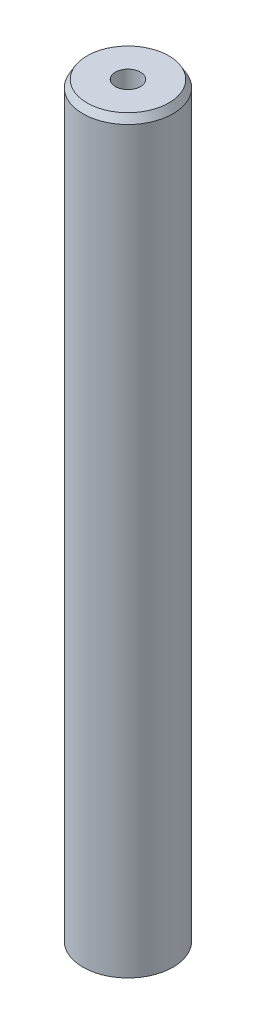
ISO-10303-21;
HEADER;
FILE_DESCRIPTION(('STEP AP214'),'2;1');
FILE_NAME('part.step','',(''),(''),'','','');
FILE_SCHEMA(('AUTOMOTIVE_DESIGN { 1 0 10303 214 1 1 1 1 }'));
ENDSEC;
DATA;
#1=APPLICATION_CONTEXT('core data for automotive mechanical design processes');
#2=APPLICATION_PROTOCOL_DEFINITION('international standard','automotive_design',2000,#1);
#3=PRODUCT_CONTEXT('',#1,'mechanical');
#4=PRODUCT('Part','Part','',(#3));
#5=PRODUCT_RELATED_PRODUCT_CATEGORY('part','',(#4));
#6=PRODUCT_DEFINITION_FORMATION('','',#4);
#7=PRODUCT_DEFINITION_CONTEXT('part definition',#1,'design');
#8=PRODUCT_DEFINITION('design','',#6,#7);
#9=PRODUCT_DEFINITION_SHAPE('','',#8);
#10=(LENGTH_UNIT() NAMED_UNIT(*) SI_UNIT(.MILLI.,.METRE.));
#11=(NAMED_UNIT(*) PLANE_ANGLE_UNIT() SI_UNIT($,.RADIAN.));
#12=(NAMED_UNIT(*) SI_UNIT($,.STERADIAN.) SOLID_ANGLE_UNIT());
#13=UNCERTAINTY_MEASURE_WITH_UNIT(LENGTH_MEASURE(1.E-05),#10,'distance_accuracy_value','');
#14=(GEOMETRIC_REPRESENTATION_CONTEXT(3) GLOBAL_UNCERTAINTY_ASSIGNED_CONTEXT((#13)) GLOBAL_UNIT_ASSIGNED_CONTEXT((#10,
#11,#12)) REPRESENTATION_CONTEXT('',''));
#15=CARTESIAN_POINT('',(0.,0.,0.));
#16=DIRECTION('',(0.,0.,1.));
#17=DIRECTION('',(1.,0.,0.));
#18=AXIS2_PLACEMENT_3D('',#15,#16,#17);
#19=CARTESIAN_POINT('',(0.,124.926275474459,0.));
#20=DIRECTION('',(0.,-1.,0.));
#21=DIRECTION('',(0.,0.,-1.));
#22=AXIS2_PLACEMENT_3D('',#19,#20,#21);
#23=CYLINDRICAL_SURFACE('',#22,7.5);
#24=CARTESIAN_POINT('',(0.,123.714764093638,0.));
#25=DIRECTION('',(0.,1.,0.));
#26=DIRECTION('',(0.,0.,1.));
#27=AXIS2_PLACEMENT_3D('',#24,#25,#26);
#28=CIRCLE('',#27,7.5);
#29=CARTESIAN_POINT('',(0.,123.714764093638,7.5));
#30=VERTEX_POINT('',#29);
#31=EDGE_CURVE('E50',#30,#30,#28,.F.);
#32=ORIENTED_EDGE('',*,*,#31,.T.);
#33=EDGE_LOOP('',(#32));
#34=FACE_BOUND('',#33,.T.);
#35=CARTESIAN_POINT('',(0.,0.699466421843153,0.));
#36=DIRECTION('',(0.,1.,0.));
#37=DIRECTION('',(0.,0.,1.));
#38=AXIS2_PLACEMENT_3D('',#35,#36,#37);
#39=CIRCLE('',#38,7.5);
#40=CARTESIAN_POINT('',(0.,0.699466421843153,7.5));
#41=VERTEX_POINT('',#40);
#42=EDGE_CURVE('E51',#41,#41,#39,.T.);
#43=ORIENTED_EDGE('',*,*,#42,.T.);
#44=EDGE_LOOP('',(#43));
#45=FACE_BOUND('',#44,.T.);
#46=ADVANCED_FACE('F39',(#34,#45),#23,.T.);
#47=CARTESIAN_POINT('',(0.,124.926275474459,0.));
#48=DIRECTION('',(0.,1.,0.));
#49=DIRECTION('',(0.,0.,1.));
#50=AXIS2_PLACEMENT_3D('',#47,#48,#49);
#51=PLANE('',#50);
#52=CARTESIAN_POINT('',(0.,124.926275474459,0.));
#53=DIRECTION('',(0.,1.,0.));
#54=DIRECTION('',(0.,0.,1.));
#55=AXIS2_PLACEMENT_3D('',#52,#53,#54);
#56=CIRCLE('',#55,6.80053357815683);
#57=CARTESIAN_POINT('',(0.,124.926275474459,6.80053357815683));
#58=VERTEX_POINT('',#57);
#59=EDGE_CURVE('E54',#58,#58,#56,.T.);
#60=ORIENTED_EDGE('',*,*,#59,.T.);
#61=EDGE_LOOP('',(#60));
#62=FACE_BOUND('',#61,.T.);
#63=CARTESIAN_POINT('',(0.,124.926275474459,0.));
#64=DIRECTION('',(0.,1.,0.));
#65=DIRECTION('',(0.,0.,1.));
#66=AXIS2_PLACEMENT_3D('',#63,#64,#65);
#67=CIRCLE('',#66,2.09012389428834);
#68=CARTESIAN_POINT('',(0.,124.926275474459,2.09012389428834));
#69=VERTEX_POINT('',#68);
#70=EDGE_CURVE('E58',#69,#69,#67,.T.);
#71=ORIENTED_EDGE('',*,*,#70,.F.);
#72=EDGE_LOOP('',(#71));
#73=FACE_BOUND('',#72,.T.);
#74=ADVANCED_FACE('F69',(#62,#73),#51,.T.);
#75=CARTESIAN_POINT('',(0.,0.,0.));
#76=DIRECTION('',(0.,1.,0.));
#77=DIRECTION('',(0.,0.,1.));
#78=AXIS2_PLACEMENT_3D('',#75,#76,#77);
#79=PLANE('',#78);
#80=CARTESIAN_POINT('',(0.,0.,0.));
#81=DIRECTION('',(0.,1.,0.));
#82=DIRECTION('',(0.,0.,1.));
#83=AXIS2_PLACEMENT_3D('',#80,#81,#82);
#84=CIRCLE('',#83,6.28848861917923);
#85=CARTESIAN_POINT('',(0.,0.,6.28848861917923));
#86=VERTEX_POINT('',#85);
#87=EDGE_CURVE('E10',#86,#86,#84,.F.);
#88=ORIENTED_EDGE('',*,*,#87,.T.);
#89=EDGE_LOOP('',(#88));
#90=FACE_BOUND('',#89,.T.);
#91=CARTESIAN_POINT('',(0.,0.,0.));
#92=DIRECTION('',(0.,1.,0.));
#93=DIRECTION('',(0.,0.,1.));
#94=AXIS2_PLACEMENT_3D('',#91,#92,#93);
#95=CIRCLE('',#94,2.09012389428834);
#96=CARTESIAN_POINT('',(0.,0.,2.09012389428834));
#97=VERTEX_POINT('',#96);
#98=EDGE_CURVE('E63',#97,#97,#95,.T.);
#99=ORIENTED_EDGE('',*,*,#98,.T.);
#100=EDGE_LOOP('',(#99));
#101=FACE_BOUND('',#100,.T.);
#102=ADVANCED_FACE('F75',(#90,#101),#79,.F.);
#103=CARTESIAN_POINT('',(0.,124.926275474459,0.));
#104=DIRECTION('',(0.,-1.,0.));
#105=DIRECTION('',(0.,0.,-1.));
#106=AXIS2_PLACEMENT_3D('',#103,#104,#105);
#107=CYLINDRICAL_SURFACE('',#106,2.09012389428834);
#108=ORIENTED_EDGE('',*,*,#70,.T.);
#109=EDGE_LOOP('',(#108));
#110=FACE_BOUND('',#109,.T.);
#111=ORIENTED_EDGE('',*,*,#98,.F.);
#112=EDGE_LOOP('',(#111));
#113=FACE_BOUND('',#112,.T.);
#114=ADVANCED_FACE('F70',(#110,#113),#107,.F.);
#115=CARTESIAN_POINT('',(0.,124.926275474459,0.));
#116=DIRECTION('',(0.,-1.,0.));
#117=DIRECTION('',(0.,0.,-1.));
#118=AXIS2_PLACEMENT_3D('',#115,#116,#117);
#119=CONICAL_SURFACE('',#118,6.80053357815683,0.523598775598291);
#120=ORIENTED_EDGE('',*,*,#31,.F.);
#121=EDGE_LOOP('',(#120));
#122=FACE_BOUND('',#121,.T.);
#123=ORIENTED_EDGE('',*,*,#59,.F.);
#124=EDGE_LOOP('',(#123));
#125=FACE_BOUND('',#124,.T.);
#126=ADVANCED_FACE('F81',(#122,#125),#119,.T.);
#127=CARTESIAN_POINT('',(0.,0.699466421843153,0.));
#128=DIRECTION('',(0.,1.,0.));
#129=DIRECTION('',(0.,0.,1.));
#130=AXIS2_PLACEMENT_3D('',#127,#128,#129);
#131=CONICAL_SURFACE('',#130,7.5,1.04719755119661);
#132=ORIENTED_EDGE('',*,*,#87,.F.);
#133=EDGE_LOOP('',(#132));
#134=FACE_BOUND('',#133,.T.);
#135=ORIENTED_EDGE('',*,*,#42,.F.);
#136=EDGE_LOOP('',(#135));
#137=FACE_BOUND('',#136,.T.);
#138=ADVANCED_FACE('F45',(#134,#137),#131,.T.);
#139=CLOSED_SHELL('',(#46,#74,#102,#114,#126,#138));
#140=MANIFOLD_SOLID_BREP('B2',#139);
#141=ADVANCED_BREP_SHAPE_REPRESENTATION('',(#18,#140),#14);
#142=SHAPE_DEFINITION_REPRESENTATION(#9,#141);
ENDSEC;
END-ISO-10303-21;
